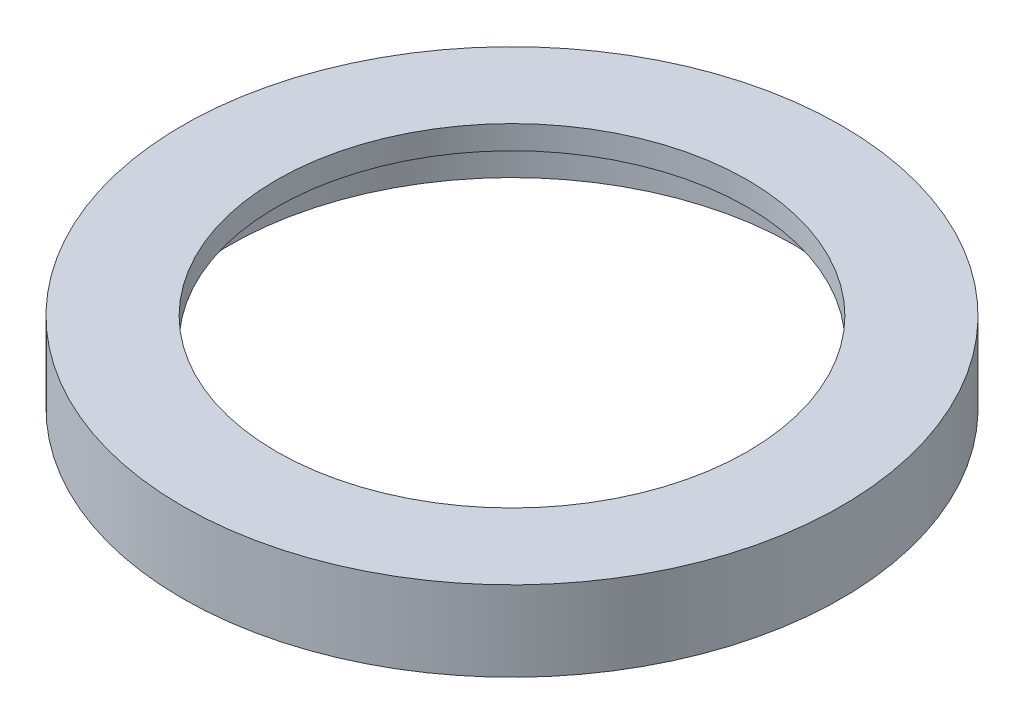
ISO-10303-21;
HEADER;
FILE_DESCRIPTION(('STEP AP214'),'2;1');
FILE_NAME('part.step','',(''),(''),'','','');
FILE_SCHEMA(('AUTOMOTIVE_DESIGN { 1 0 10303 214 1 1 1 1 }'));
ENDSEC;
DATA;
#1=APPLICATION_CONTEXT('core data for automotive mechanical design processes');
#2=APPLICATION_PROTOCOL_DEFINITION('international standard','automotive_design',2000,#1);
#3=PRODUCT_CONTEXT('',#1,'mechanical');
#4=PRODUCT('Part','Part','',(#3));
#5=PRODUCT_RELATED_PRODUCT_CATEGORY('part','',(#4));
#6=PRODUCT_DEFINITION_FORMATION('','',#4);
#7=PRODUCT_DEFINITION_CONTEXT('part definition',#1,'design');
#8=PRODUCT_DEFINITION('design','',#6,#7);
#9=PRODUCT_DEFINITION_SHAPE('','',#8);
#10=(LENGTH_UNIT() NAMED_UNIT(*) SI_UNIT(.MILLI.,.METRE.));
#11=(NAMED_UNIT(*) PLANE_ANGLE_UNIT() SI_UNIT($,.RADIAN.));
#12=(NAMED_UNIT(*) SI_UNIT($,.STERADIAN.) SOLID_ANGLE_UNIT());
#13=UNCERTAINTY_MEASURE_WITH_UNIT(LENGTH_MEASURE(1.E-05),#10,'distance_accuracy_value','');
#14=(GEOMETRIC_REPRESENTATION_CONTEXT(3) GLOBAL_UNCERTAINTY_ASSIGNED_CONTEXT((#13)) GLOBAL_UNIT_ASSIGNED_CONTEXT((#10,
#11,#12)) REPRESENTATION_CONTEXT('',''));
#15=CARTESIAN_POINT('',(0.,0.,0.));
#16=DIRECTION('',(0.,0.,1.));
#17=DIRECTION('',(1.,0.,0.));
#18=AXIS2_PLACEMENT_3D('',#15,#16,#17);
#19=CARTESIAN_POINT('',(0.,85.,0.));
#20=DIRECTION('',(0.,-1.,0.));
#21=DIRECTION('',(0.,0.,-1.));
#22=AXIS2_PLACEMENT_3D('',#19,#20,#21);
#23=CYLINDRICAL_SURFACE('',#22,250.);
#24=CARTESIAN_POINT('',(0.,85.,0.));
#25=DIRECTION('',(0.,1.,0.));
#26=DIRECTION('',(0.,0.,1.));
#27=AXIS2_PLACEMENT_3D('',#24,#25,#26);
#28=CIRCLE('',#27,250.);
#29=CARTESIAN_POINT('',(0.,85.,250.));
#30=VERTEX_POINT('',#29);
#31=EDGE_CURVE('E44',#30,#30,#28,.T.);
#32=ORIENTED_EDGE('',*,*,#31,.T.);
#33=EDGE_LOOP('',(#32));
#34=FACE_BOUND('',#33,.T.);
#35=CARTESIAN_POINT('',(0.,60.,0.));
#36=DIRECTION('',(0.,-1.,0.));
#37=DIRECTION('',(0.,0.,-1.));
#38=AXIS2_PLACEMENT_3D('',#35,#36,#37);
#39=CIRCLE('',#38,250.);
#40=CARTESIAN_POINT('',(0.,60.,-250.));
#41=VERTEX_POINT('',#40);
#42=EDGE_CURVE('E35',#41,#41,#39,.T.);
#43=ORIENTED_EDGE('',*,*,#42,.T.);
#44=EDGE_LOOP('',(#43));
#45=FACE_BOUND('',#44,.T.);
#46=ADVANCED_FACE('F31',(#34,#45),#23,.F.);
#47=CARTESIAN_POINT('',(0.,85.,0.));
#48=DIRECTION('',(0.,1.,0.));
#49=DIRECTION('',(0.,0.,1.));
#50=AXIS2_PLACEMENT_3D('',#47,#48,#49);
#51=PLANE('',#50);
#52=CARTESIAN_POINT('',(0.,85.,0.));
#53=DIRECTION('',(0.,1.,0.));
#54=DIRECTION('',(0.,0.,1.));
#55=AXIS2_PLACEMENT_3D('',#52,#53,#54);
#56=CIRCLE('',#55,350.);
#57=CARTESIAN_POINT('',(0.,85.,350.));
#58=VERTEX_POINT('',#57);
#59=EDGE_CURVE('E10',#58,#58,#56,.T.);
#60=ORIENTED_EDGE('',*,*,#59,.T.);
#61=EDGE_LOOP('',(#60));
#62=FACE_BOUND('',#61,.T.);
#63=ORIENTED_EDGE('',*,*,#31,.F.);
#64=EDGE_LOOP('',(#63));
#65=FACE_BOUND('',#64,.T.);
#66=ADVANCED_FACE('F69',(#62,#65),#51,.T.);
#67=CARTESIAN_POINT('',(0.,0.,0.));
#68=DIRECTION('',(0.,1.,0.));
#69=DIRECTION('',(0.,0.,1.));
#70=AXIS2_PLACEMENT_3D('',#67,#68,#69);
#71=PLANE('',#70);
#72=CARTESIAN_POINT('',(0.,0.,0.));
#73=DIRECTION('',(0.,-1.,0.));
#74=DIRECTION('',(0.,0.,-1.));
#75=AXIS2_PLACEMENT_3D('',#72,#73,#74);
#76=CIRCLE('',#75,300.);
#77=CARTESIAN_POINT('',(0.,0.,-300.));
#78=VERTEX_POINT('',#77);
#79=EDGE_CURVE('E48',#78,#78,#76,.T.);
#80=ORIENTED_EDGE('',*,*,#79,.F.);
#81=EDGE_LOOP('',(#80));
#82=FACE_BOUND('',#81,.T.);
#83=CARTESIAN_POINT('',(0.,0.,0.));
#84=DIRECTION('',(0.,1.,0.));
#85=DIRECTION('',(0.,0.,1.));
#86=AXIS2_PLACEMENT_3D('',#83,#84,#85);
#87=CIRCLE('',#86,350.);
#88=CARTESIAN_POINT('',(0.,0.,350.));
#89=VERTEX_POINT('',#88);
#90=EDGE_CURVE('E39',#89,#89,#87,.T.);
#91=ORIENTED_EDGE('',*,*,#90,.F.);
#92=EDGE_LOOP('',(#91));
#93=FACE_BOUND('',#92,.T.);
#94=ADVANCED_FACE('F75',(#82,#93),#71,.F.);
#95=CARTESIAN_POINT('',(0.,85.,0.));
#96=DIRECTION('',(0.,-1.,0.));
#97=DIRECTION('',(0.,0.,-1.));
#98=AXIS2_PLACEMENT_3D('',#95,#96,#97);
#99=CYLINDRICAL_SURFACE('',#98,350.);
#100=ORIENTED_EDGE('',*,*,#59,.F.);
#101=EDGE_LOOP('',(#100));
#102=FACE_BOUND('',#101,.T.);
#103=ORIENTED_EDGE('',*,*,#90,.T.);
#104=EDGE_LOOP('',(#103));
#105=FACE_BOUND('',#104,.T.);
#106=ADVANCED_FACE('F33',(#102,#105),#99,.T.);
#107=CARTESIAN_POINT('',(0.,60.,0.));
#108=DIRECTION('',(0.,-1.,0.));
#109=DIRECTION('',(0.,0.,-1.));
#110=AXIS2_PLACEMENT_3D('',#107,#108,#109);
#111=CYLINDRICAL_SURFACE('',#110,300.);
#112=CARTESIAN_POINT('',(0.,60.,0.));
#113=DIRECTION('',(0.,-1.,0.));
#114=DIRECTION('',(0.,0.,-1.));
#115=AXIS2_PLACEMENT_3D('',#112,#113,#114);
#116=CIRCLE('',#115,300.);
#117=CARTESIAN_POINT('',(0.,60.,-300.));
#118=VERTEX_POINT('',#117);
#119=EDGE_CURVE('E51',#118,#118,#116,.T.);
#120=ORIENTED_EDGE('',*,*,#119,.F.);
#121=EDGE_LOOP('',(#120));
#122=FACE_BOUND('',#121,.T.);
#123=ORIENTED_EDGE('',*,*,#79,.T.);
#124=EDGE_LOOP('',(#123));
#125=FACE_BOUND('',#124,.T.);
#126=ADVANCED_FACE('F61',(#122,#125),#111,.F.);
#127=CARTESIAN_POINT('',(0.,60.,0.));
#128=DIRECTION('',(0.,-1.,0.));
#129=DIRECTION('',(0.,0.,-1.));
#130=AXIS2_PLACEMENT_3D('',#127,#128,#129);
#131=PLANE('',#130);
#132=ORIENTED_EDGE('',*,*,#42,.F.);
#133=EDGE_LOOP('',(#132));
#134=FACE_BOUND('',#133,.T.);
#135=ORIENTED_EDGE('',*,*,#119,.T.);
#136=EDGE_LOOP('',(#135));
#137=FACE_BOUND('',#136,.T.);
#138=ADVANCED_FACE('F59',(#134,#137),#131,.T.);
#139=CLOSED_SHELL('',(#46,#66,#94,#106,#126,#138));
#140=MANIFOLD_SOLID_BREP('B2',#139);
#141=ADVANCED_BREP_SHAPE_REPRESENTATION('',(#18,#140),#14);
#142=SHAPE_DEFINITION_REPRESENTATION(#9,#141);
ENDSEC;
END-ISO-10303-21;
